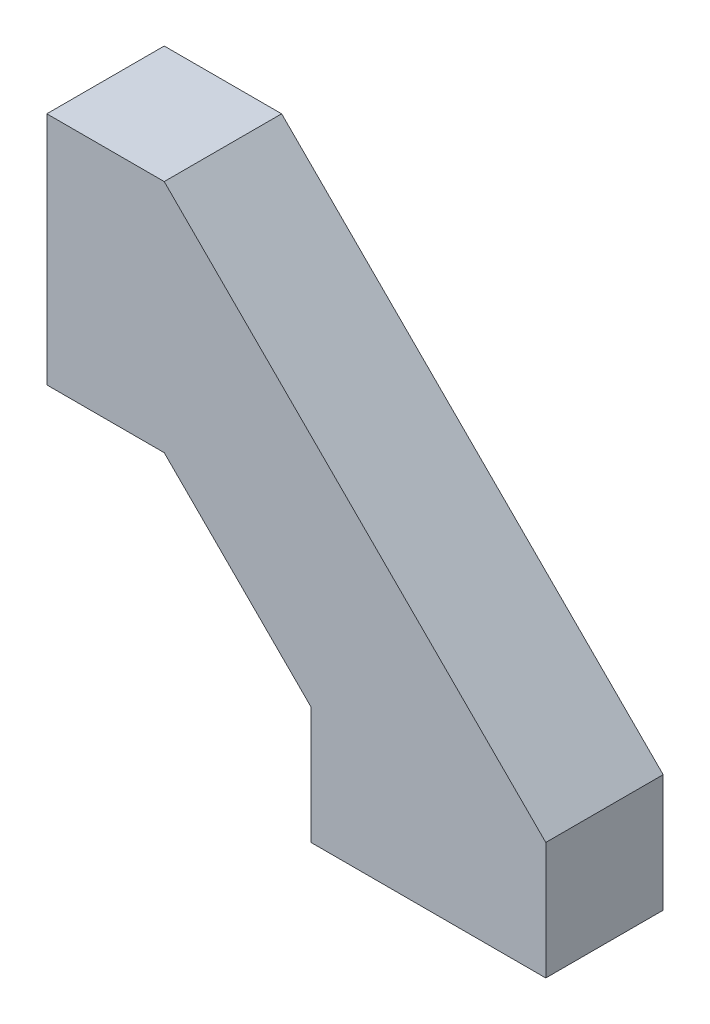
ISO-10303-21;
HEADER;
FILE_DESCRIPTION(('STEP AP214'),'2;1');
FILE_NAME('part.step','',(''),(''),'','','');
FILE_SCHEMA(('AUTOMOTIVE_DESIGN { 1 0 10303 214 1 1 1 1 }'));
ENDSEC;
DATA;
#1=APPLICATION_CONTEXT('core data for automotive mechanical design processes');
#2=APPLICATION_PROTOCOL_DEFINITION('international standard','automotive_design',2000,#1);
#3=PRODUCT_CONTEXT('',#1,'mechanical');
#4=PRODUCT('Part','Part','',(#3));
#5=PRODUCT_RELATED_PRODUCT_CATEGORY('part','',(#4));
#6=PRODUCT_DEFINITION_FORMATION('','',#4);
#7=PRODUCT_DEFINITION_CONTEXT('part definition',#1,'design');
#8=PRODUCT_DEFINITION('design','',#6,#7);
#9=PRODUCT_DEFINITION_SHAPE('','',#8);
#10=(LENGTH_UNIT() NAMED_UNIT(*) SI_UNIT(.MILLI.,.METRE.));
#11=(NAMED_UNIT(*) PLANE_ANGLE_UNIT() SI_UNIT($,.RADIAN.));
#12=(NAMED_UNIT(*) SI_UNIT($,.STERADIAN.) SOLID_ANGLE_UNIT());
#13=UNCERTAINTY_MEASURE_WITH_UNIT(LENGTH_MEASURE(1.E-05),#10,'distance_accuracy_value','');
#14=(GEOMETRIC_REPRESENTATION_CONTEXT(3) GLOBAL_UNCERTAINTY_ASSIGNED_CONTEXT((#13)) GLOBAL_UNIT_ASSIGNED_CONTEXT((#10,
#11,#12)) REPRESENTATION_CONTEXT('',''));
#15=CARTESIAN_POINT('',(0.,0.,0.));
#16=DIRECTION('',(0.,0.,1.));
#17=DIRECTION('',(1.,0.,0.));
#18=AXIS2_PLACEMENT_3D('',#15,#16,#17);
#19=CARTESIAN_POINT('',(2.,2.00000000000001,4.));
#20=DIRECTION('',(-0.707106781186546,-0.707106781186549,0.));
#21=DIRECTION('',(0.707106781186549,-0.707106781186546,0.));
#22=AXIS2_PLACEMENT_3D('',#19,#20,#21);
#23=PLANE('',#22);
#24=DIRECTION('',(-0.707106781186549,0.707106781186546,0.));
#25=VECTOR('',#24,1.);
#26=CARTESIAN_POINT('',(2.,2.00000000000001,0.));
#27=LINE('',#26,#25);
#28=CARTESIAN_POINT('',(0.,4.,0.));
#29=VERTEX_POINT('',#28);
#30=CARTESIAN_POINT('',(-13.,17.,0.));
#31=VERTEX_POINT('',#30);
#32=EDGE_CURVE('E140',#29,#31,#27,.T.);
#33=ORIENTED_EDGE('',*,*,#32,.T.);
#34=DIRECTION('',(0.,0.,-1.));
#35=VECTOR('',#34,1.);
#36=CARTESIAN_POINT('',(-13.,17.,4.));
#37=LINE('',#36,#35);
#38=CARTESIAN_POINT('',(-13.,17.,4.));
#39=VERTEX_POINT('',#38);
#40=EDGE_CURVE('E11',#39,#31,#37,.T.);
#41=ORIENTED_EDGE('',*,*,#40,.F.);
#42=DIRECTION('',(-0.707106781186549,0.707106781186546,0.));
#43=VECTOR('',#42,1.);
#44=CARTESIAN_POINT('',(2.,2.00000000000001,4.));
#45=LINE('',#44,#43);
#46=CARTESIAN_POINT('',(0.,4.,4.));
#47=VERTEX_POINT('',#46);
#48=EDGE_CURVE('E94',#47,#39,#45,.T.);
#49=ORIENTED_EDGE('',*,*,#48,.F.);
#50=DIRECTION('',(0.,0.,-1.));
#51=VECTOR('',#50,1.);
#52=CARTESIAN_POINT('',(0.,4.,4.));
#53=LINE('',#52,#51);
#54=EDGE_CURVE('E136',#47,#29,#53,.T.);
#55=ORIENTED_EDGE('',*,*,#54,.T.);
#56=EDGE_LOOP('',(#33,#41,#49,#55));
#57=FACE_BOUND('',#56,.T.);
#58=ADVANCED_FACE('F41',(#57),#23,.F.);
#59=CARTESIAN_POINT('',(0.,17.,4.));
#60=DIRECTION('',(0.,1.,0.));
#61=DIRECTION('',(0.,0.,1.));
#62=AXIS2_PLACEMENT_3D('',#59,#60,#61);
#63=PLANE('',#62);
#64=DIRECTION('',(1.,0.,0.));
#65=VECTOR('',#64,1.);
#66=CARTESIAN_POINT('',(0.,17.,0.));
#67=LINE('',#66,#65);
#68=CARTESIAN_POINT('',(-17.,17.,0.));
#69=VERTEX_POINT('',#68);
#70=EDGE_CURVE('E144',#69,#31,#67,.T.);
#71=ORIENTED_EDGE('',*,*,#70,.F.);
#72=DIRECTION('',(0.,0.,-1.));
#73=VECTOR('',#72,1.);
#74=CARTESIAN_POINT('',(-17.,17.,4.));
#75=LINE('',#74,#73);
#76=CARTESIAN_POINT('',(-17.,17.,4.));
#77=VERTEX_POINT('',#76);
#78=EDGE_CURVE('E50',#77,#69,#75,.T.);
#79=ORIENTED_EDGE('',*,*,#78,.F.);
#80=DIRECTION('',(1.,0.,0.));
#81=VECTOR('',#80,1.);
#82=CARTESIAN_POINT('',(0.,17.,4.));
#83=LINE('',#82,#81);
#84=EDGE_CURVE('E198',#77,#39,#83,.T.);
#85=ORIENTED_EDGE('',*,*,#84,.T.);
#86=ORIENTED_EDGE('',*,*,#40,.T.);
#87=EDGE_LOOP('',(#71,#79,#85,#86));
#88=FACE_BOUND('',#87,.T.);
#89=ADVANCED_FACE('F188',(#88),#63,.T.);
#90=CARTESIAN_POINT('',(-17.,0.,4.));
#91=DIRECTION('',(-1.,0.,0.));
#92=DIRECTION('',(0.,-1.,0.));
#93=AXIS2_PLACEMENT_3D('',#90,#91,#92);
#94=PLANE('',#93);
#95=DIRECTION('',(0.,1.,0.));
#96=VECTOR('',#95,1.);
#97=CARTESIAN_POINT('',(-17.,0.,0.));
#98=LINE('',#97,#96);
#99=CARTESIAN_POINT('',(-17.,9.,0.));
#100=VERTEX_POINT('',#99);
#101=EDGE_CURVE('E148',#100,#69,#98,.T.);
#102=ORIENTED_EDGE('',*,*,#101,.F.);
#103=DIRECTION('',(0.,0.,-1.));
#104=VECTOR('',#103,1.);
#105=CARTESIAN_POINT('',(-17.,9.,4.));
#106=LINE('',#105,#104);
#107=CARTESIAN_POINT('',(-17.,9.,4.));
#108=VERTEX_POINT('',#107);
#109=EDGE_CURVE('E176',#108,#100,#106,.T.);
#110=ORIENTED_EDGE('',*,*,#109,.F.);
#111=DIRECTION('',(0.,1.,0.));
#112=VECTOR('',#111,1.);
#113=CARTESIAN_POINT('',(-17.,0.,4.));
#114=LINE('',#113,#112);
#115=EDGE_CURVE('E185',#108,#77,#114,.T.);
#116=ORIENTED_EDGE('',*,*,#115,.T.);
#117=ORIENTED_EDGE('',*,*,#78,.T.);
#118=EDGE_LOOP('',(#102,#110,#116,#117));
#119=FACE_BOUND('',#118,.T.);
#120=ADVANCED_FACE('F183',(#119),#94,.T.);
#121=CARTESIAN_POINT('',(0.,9.,4.));
#122=DIRECTION('',(0.,-1.,0.));
#123=DIRECTION('',(1.,0.,0.));
#124=AXIS2_PLACEMENT_3D('',#121,#122,#123);
#125=PLANE('',#124);
#126=DIRECTION('',(-1.,0.,0.));
#127=VECTOR('',#126,1.);
#128=CARTESIAN_POINT('',(0.,9.,0.));
#129=LINE('',#128,#127);
#130=CARTESIAN_POINT('',(-13.,9.,0.));
#131=VERTEX_POINT('',#130);
#132=EDGE_CURVE('E152',#131,#100,#129,.T.);
#133=ORIENTED_EDGE('',*,*,#132,.F.);
#134=DIRECTION('',(0.,0.,-1.));
#135=VECTOR('',#134,1.);
#136=CARTESIAN_POINT('',(-13.,9.,4.));
#137=LINE('',#136,#135);
#138=CARTESIAN_POINT('',(-13.,9.,4.));
#139=VERTEX_POINT('',#138);
#140=EDGE_CURVE('E173',#139,#131,#137,.T.);
#141=ORIENTED_EDGE('',*,*,#140,.F.);
#142=DIRECTION('',(-1.,0.,0.));
#143=VECTOR('',#142,1.);
#144=CARTESIAN_POINT('',(0.,9.,4.));
#145=LINE('',#144,#143);
#146=EDGE_CURVE('E197',#139,#108,#145,.T.);
#147=ORIENTED_EDGE('',*,*,#146,.T.);
#148=ORIENTED_EDGE('',*,*,#109,.T.);
#149=EDGE_LOOP('',(#133,#141,#147,#148));
#150=FACE_BOUND('',#149,.T.);
#151=ADVANCED_FACE('F195',(#150),#125,.T.);
#152=CARTESIAN_POINT('',(-1.99999999999999,-1.99999999999999,4.));
#153=DIRECTION('',(-0.707106781186546,-0.707106781186549,0.));
#154=DIRECTION('',(0.707106781186549,-0.707106781186546,0.));
#155=AXIS2_PLACEMENT_3D('',#152,#153,#154);
#156=PLANE('',#155);
#157=DIRECTION('',(-0.707106781186549,0.707106781186546,0.));
#158=VECTOR('',#157,1.);
#159=CARTESIAN_POINT('',(-1.99999999999999,-1.99999999999999,0.));
#160=LINE('',#159,#158);
#161=CARTESIAN_POINT('',(-8.,4.,0.));
#162=VERTEX_POINT('',#161);
#163=EDGE_CURVE('E156',#162,#131,#160,.T.);
#164=ORIENTED_EDGE('',*,*,#163,.F.);
#165=DIRECTION('',(0.,0.,-1.));
#166=VECTOR('',#165,1.);
#167=CARTESIAN_POINT('',(-8.,4.,4.));
#168=LINE('',#167,#166);
#169=CARTESIAN_POINT('',(-8.,4.,4.));
#170=VERTEX_POINT('',#169);
#171=EDGE_CURVE('E122',#170,#162,#168,.T.);
#172=ORIENTED_EDGE('',*,*,#171,.F.);
#173=DIRECTION('',(-0.707106781186549,0.707106781186546,0.));
#174=VECTOR('',#173,1.);
#175=CARTESIAN_POINT('',(-1.99999999999999,-1.99999999999999,4.));
#176=LINE('',#175,#174);
#177=EDGE_CURVE('E129',#170,#139,#176,.T.);
#178=ORIENTED_EDGE('',*,*,#177,.T.);
#179=ORIENTED_EDGE('',*,*,#140,.T.);
#180=EDGE_LOOP('',(#164,#172,#178,#179));
#181=FACE_BOUND('',#180,.T.);
#182=ADVANCED_FACE('F208',(#181),#156,.T.);
#183=CARTESIAN_POINT('',(-8.,0.,4.));
#184=DIRECTION('',(-1.,0.,0.));
#185=DIRECTION('',(0.,0.,1.));
#186=AXIS2_PLACEMENT_3D('',#183,#184,#185);
#187=PLANE('',#186);
#188=DIRECTION('',(0.,1.,0.));
#189=VECTOR('',#188,1.);
#190=CARTESIAN_POINT('',(-8.,0.,0.));
#191=LINE('',#190,#189);
#192=CARTESIAN_POINT('',(-8.,0.,0.));
#193=VERTEX_POINT('',#192);
#194=EDGE_CURVE('E116',#193,#162,#191,.T.);
#195=ORIENTED_EDGE('',*,*,#194,.F.);
#196=DIRECTION('',(0.,0.,-1.));
#197=VECTOR('',#196,1.);
#198=CARTESIAN_POINT('',(-8.,0.,4.));
#199=LINE('',#198,#197);
#200=CARTESIAN_POINT('',(-8.,0.,4.));
#201=VERTEX_POINT('',#200);
#202=EDGE_CURVE('E111',#201,#193,#199,.T.);
#203=ORIENTED_EDGE('',*,*,#202,.F.);
#204=DIRECTION('',(0.,1.,0.));
#205=VECTOR('',#204,1.);
#206=CARTESIAN_POINT('',(-8.,0.,4.));
#207=LINE('',#206,#205);
#208=EDGE_CURVE('E114',#201,#170,#207,.T.);
#209=ORIENTED_EDGE('',*,*,#208,.T.);
#210=ORIENTED_EDGE('',*,*,#171,.T.);
#211=EDGE_LOOP('',(#195,#203,#209,#210));
#212=FACE_BOUND('',#211,.T.);
#213=ADVANCED_FACE('F113',(#212),#187,.T.);
#214=CARTESIAN_POINT('',(0.,0.,4.));
#215=DIRECTION('',(0.,-1.,0.));
#216=DIRECTION('',(0.,0.,-1.));
#217=AXIS2_PLACEMENT_3D('',#214,#215,#216);
#218=PLANE('',#217);
#219=DIRECTION('',(-1.,0.,0.));
#220=VECTOR('',#219,1.);
#221=CARTESIAN_POINT('',(0.,0.,0.));
#222=LINE('',#221,#220);
#223=CARTESIAN_POINT('',(0.,0.,0.));
#224=VERTEX_POINT('',#223);
#225=EDGE_CURVE('E162',#224,#193,#222,.T.);
#226=ORIENTED_EDGE('',*,*,#225,.F.);
#227=DIRECTION('',(0.,0.,-1.));
#228=VECTOR('',#227,1.);
#229=CARTESIAN_POINT('',(0.,0.,4.));
#230=LINE('',#229,#228);
#231=CARTESIAN_POINT('',(0.,0.,4.));
#232=VERTEX_POINT('',#231);
#233=EDGE_CURVE('E85',#232,#224,#230,.T.);
#234=ORIENTED_EDGE('',*,*,#233,.F.);
#235=DIRECTION('',(-1.,0.,0.));
#236=VECTOR('',#235,1.);
#237=CARTESIAN_POINT('',(0.,0.,4.));
#238=LINE('',#237,#236);
#239=EDGE_CURVE('E126',#232,#201,#238,.T.);
#240=ORIENTED_EDGE('',*,*,#239,.T.);
#241=ORIENTED_EDGE('',*,*,#202,.T.);
#242=EDGE_LOOP('',(#226,#234,#240,#241));
#243=FACE_BOUND('',#242,.T.);
#244=ADVANCED_FACE('F132',(#243),#218,.T.);
#245=CARTESIAN_POINT('',(0.,0.,4.));
#246=DIRECTION('',(-1.,0.,0.));
#247=DIRECTION('',(0.,0.,1.));
#248=AXIS2_PLACEMENT_3D('',#245,#246,#247);
#249=PLANE('',#248);
#250=DIRECTION('',(0.,1.,0.));
#251=VECTOR('',#250,1.);
#252=CARTESIAN_POINT('',(0.,0.,0.));
#253=LINE('',#252,#251);
#254=EDGE_CURVE('E88',#224,#29,#253,.T.);
#255=ORIENTED_EDGE('',*,*,#254,.T.);
#256=ORIENTED_EDGE('',*,*,#54,.F.);
#257=DIRECTION('',(0.,1.,0.));
#258=VECTOR('',#257,1.);
#259=CARTESIAN_POINT('',(0.,0.,4.));
#260=LINE('',#259,#258);
#261=EDGE_CURVE('E58',#232,#47,#260,.T.);
#262=ORIENTED_EDGE('',*,*,#261,.F.);
#263=ORIENTED_EDGE('',*,*,#233,.T.);
#264=EDGE_LOOP('',(#255,#256,#262,#263));
#265=FACE_BOUND('',#264,.T.);
#266=ADVANCED_FACE('F210',(#265),#249,.F.);
#267=CARTESIAN_POINT('',(0.,0.,4.));
#268=DIRECTION('',(0.,0.,1.));
#269=DIRECTION('',(1.,0.,0.));
#270=AXIS2_PLACEMENT_3D('',#267,#268,#269);
#271=PLANE('',#270);
#272=ORIENTED_EDGE('',*,*,#48,.T.);
#273=ORIENTED_EDGE('',*,*,#84,.F.);
#274=ORIENTED_EDGE('',*,*,#115,.F.);
#275=ORIENTED_EDGE('',*,*,#146,.F.);
#276=ORIENTED_EDGE('',*,*,#177,.F.);
#277=ORIENTED_EDGE('',*,*,#208,.F.);
#278=ORIENTED_EDGE('',*,*,#239,.F.);
#279=ORIENTED_EDGE('',*,*,#261,.T.);
#280=EDGE_LOOP('',(#272,#273,#274,#275,#276,#277,#278,#279));
#281=FACE_BOUND('',#280,.T.);
#282=ADVANCED_FACE('F125',(#281),#271,.T.);
#283=CARTESIAN_POINT('',(0.,0.,0.));
#284=DIRECTION('',(0.,0.,1.));
#285=DIRECTION('',(1.,0.,0.));
#286=AXIS2_PLACEMENT_3D('',#283,#284,#285);
#287=PLANE('',#286);
#288=ORIENTED_EDGE('',*,*,#32,.F.);
#289=ORIENTED_EDGE('',*,*,#254,.F.);
#290=ORIENTED_EDGE('',*,*,#225,.T.);
#291=ORIENTED_EDGE('',*,*,#194,.T.);
#292=ORIENTED_EDGE('',*,*,#163,.T.);
#293=ORIENTED_EDGE('',*,*,#132,.T.);
#294=ORIENTED_EDGE('',*,*,#101,.T.);
#295=ORIENTED_EDGE('',*,*,#70,.T.);
#296=EDGE_LOOP('',(#288,#289,#290,#291,#292,#293,#294,#295));
#297=FACE_BOUND('',#296,.T.);
#298=ADVANCED_FACE('F191',(#297),#287,.F.);
#299=CLOSED_SHELL('',(#58,#89,#120,#151,#182,#213,#244,#266,#282,#298));
#300=MANIFOLD_SOLID_BREP('B2',#299);
#301=ADVANCED_BREP_SHAPE_REPRESENTATION('',(#18,#300),#14);
#302=SHAPE_DEFINITION_REPRESENTATION(#9,#301);
ENDSEC;
END-ISO-10303-21;
